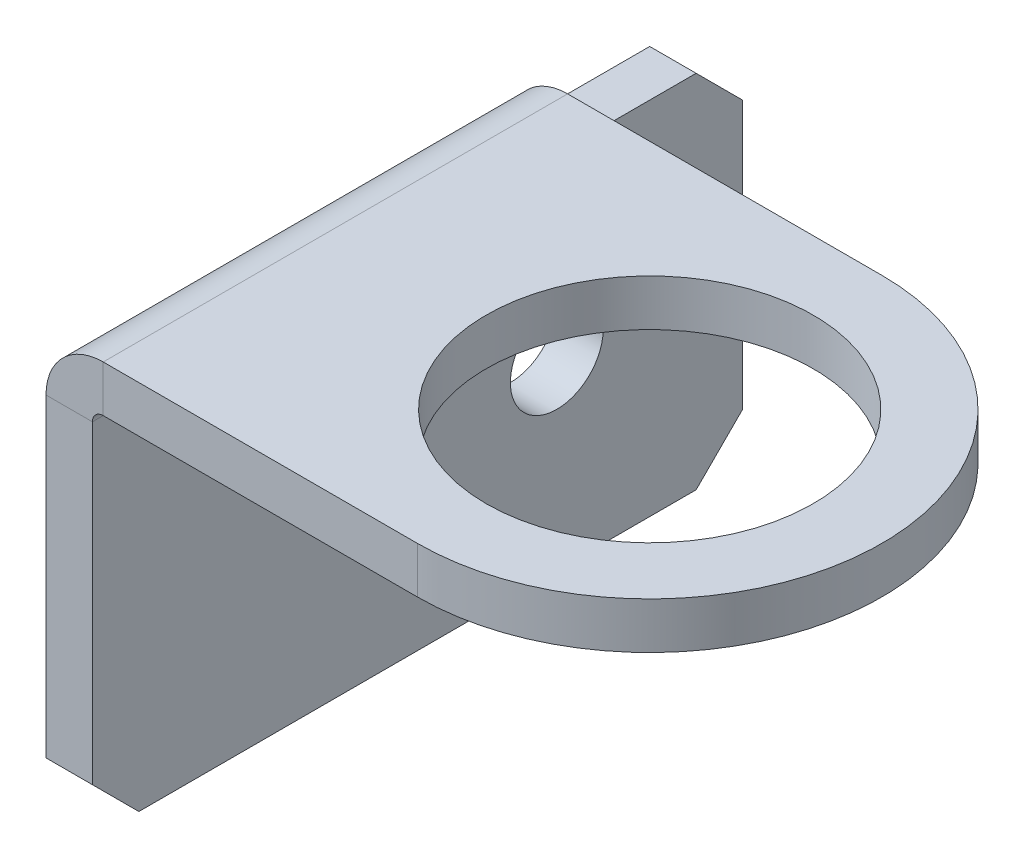
ISO-10303-21;
HEADER;
FILE_DESCRIPTION(('STEP AP214'),'2;1');
FILE_NAME('part.step','',(''),(''),'','','');
FILE_SCHEMA(('AUTOMOTIVE_DESIGN { 1 0 10303 214 1 1 1 1 }'));
ENDSEC;
DATA;
#1=APPLICATION_CONTEXT('core data for automotive mechanical design processes');
#2=APPLICATION_PROTOCOL_DEFINITION('international standard','automotive_design',2000,#1);
#3=PRODUCT_CONTEXT('',#1,'mechanical');
#4=PRODUCT('Part','Part','',(#3));
#5=PRODUCT_RELATED_PRODUCT_CATEGORY('part','',(#4));
#6=PRODUCT_DEFINITION_FORMATION('','',#4);
#7=PRODUCT_DEFINITION_CONTEXT('part definition',#1,'design');
#8=PRODUCT_DEFINITION('design','',#6,#7);
#9=PRODUCT_DEFINITION_SHAPE('','',#8);
#10=(LENGTH_UNIT() NAMED_UNIT(*) SI_UNIT(.MILLI.,.METRE.));
#11=(NAMED_UNIT(*) PLANE_ANGLE_UNIT() SI_UNIT($,.RADIAN.));
#12=(NAMED_UNIT(*) SI_UNIT($,.STERADIAN.) SOLID_ANGLE_UNIT());
#13=UNCERTAINTY_MEASURE_WITH_UNIT(LENGTH_MEASURE(1.E-05),#10,'distance_accuracy_value','');
#14=(GEOMETRIC_REPRESENTATION_CONTEXT(3) GLOBAL_UNCERTAINTY_ASSIGNED_CONTEXT((#13)) GLOBAL_UNIT_ASSIGNED_CONTEXT((#10,
#11,#12)) REPRESENTATION_CONTEXT('',''));
#15=CARTESIAN_POINT('',(0.,0.,0.));
#16=DIRECTION('',(0.,0.,1.));
#17=DIRECTION('',(1.,0.,0.));
#18=AXIS2_PLACEMENT_3D('',#15,#16,#17);
#19=CARTESIAN_POINT('',(0.,0.,15.875));
#20=DIRECTION('',(0.,1.,0.));
#21=DIRECTION('',(0.,0.,1.));
#22=AXIS2_PLACEMENT_3D('',#19,#20,#21);
#23=PLANE('',#22);
#24=CARTESIAN_POINT('',(22.225,0.,0.));
#25=DIRECTION('',(0.,1.,0.));
#26=DIRECTION('',(0.,0.,1.));
#27=AXIS2_PLACEMENT_3D('',#24,#25,#26);
#28=CIRCLE('',#27,11.176);
#29=CARTESIAN_POINT('',(22.225,0.,11.176));
#30=VERTEX_POINT('',#29);
#31=EDGE_CURVE('E274',#30,#30,#28,.T.);
#32=ORIENTED_EDGE('',*,*,#31,.T.);
#33=EDGE_LOOP('',(#32));
#34=FACE_BOUND('',#33,.T.);
#35=CARTESIAN_POINT('',(22.225,0.,0.));
#36=DIRECTION('',(0.,1.,0.));
#37=DIRECTION('',(0.,0.,1.));
#38=AXIS2_PLACEMENT_3D('',#35,#36,#37);
#39=CIRCLE('',#38,15.875);
#40=CARTESIAN_POINT('',(22.225,0.,15.875));
#41=VERTEX_POINT('',#40);
#42=CARTESIAN_POINT('',(22.225,0.,-15.875));
#43=VERTEX_POINT('',#42);
#44=EDGE_CURVE('E266',#41,#43,#39,.T.);
#45=ORIENTED_EDGE('',*,*,#44,.F.);
#46=DIRECTION('',(1.,0.,0.));
#47=VECTOR('',#46,1.);
#48=CARTESIAN_POINT('',(0.,0.,15.875));
#49=LINE('',#48,#47);
#50=CARTESIAN_POINT('',(0.7366,0.,15.875));
#51=VERTEX_POINT('',#50);
#52=EDGE_CURVE('E190',#51,#41,#49,.T.);
#53=ORIENTED_EDGE('',*,*,#52,.F.);
#54=DIRECTION('',(0.,0.,-1.));
#55=VECTOR('',#54,1.);
#56=CARTESIAN_POINT('',(0.7366,0.,15.875));
#57=LINE('',#56,#55);
#58=CARTESIAN_POINT('',(0.7366,0.,-15.875));
#59=VERTEX_POINT('',#58);
#60=EDGE_CURVE('E197',#51,#59,#57,.T.);
#61=ORIENTED_EDGE('',*,*,#60,.T.);
#62=DIRECTION('',(1.,0.,0.));
#63=VECTOR('',#62,1.);
#64=CARTESIAN_POINT('',(0.,0.,-15.875));
#65=LINE('',#64,#63);
#66=EDGE_CURVE('E193',#59,#43,#65,.T.);
#67=ORIENTED_EDGE('',*,*,#66,.T.);
#68=EDGE_LOOP('',(#45,#53,#61,#67));
#69=FACE_BOUND('',#68,.T.);
#70=ADVANCED_FACE('F63',(#34,#69),#23,.F.);
#71=CARTESIAN_POINT('',(0.,3.175,15.875));
#72=DIRECTION('',(0.,1.,0.));
#73=DIRECTION('',(0.,0.,1.));
#74=AXIS2_PLACEMENT_3D('',#71,#72,#73);
#75=PLANE('',#74);
#76=CARTESIAN_POINT('',(22.225,3.175,0.));
#77=DIRECTION('',(0.,1.,0.));
#78=DIRECTION('',(0.,0.,1.));
#79=AXIS2_PLACEMENT_3D('',#76,#77,#78);
#80=CIRCLE('',#79,11.176);
#81=CARTESIAN_POINT('',(22.225,3.175,11.176));
#82=VERTEX_POINT('',#81);
#83=EDGE_CURVE('E273',#82,#82,#80,.T.);
#84=ORIENTED_EDGE('',*,*,#83,.F.);
#85=EDGE_LOOP('',(#84));
#86=FACE_BOUND('',#85,.T.);
#87=DIRECTION('',(1.,0.,0.));
#88=VECTOR('',#87,1.);
#89=CARTESIAN_POINT('',(0.,3.175,15.875));
#90=LINE('',#89,#88);
#91=CARTESIAN_POINT('',(0.7366,3.175,15.875));
#92=VERTEX_POINT('',#91);
#93=CARTESIAN_POINT('',(22.225,3.175,15.875));
#94=VERTEX_POINT('',#93);
#95=EDGE_CURVE('E281',#92,#94,#90,.T.);
#96=ORIENTED_EDGE('',*,*,#95,.T.);
#97=CARTESIAN_POINT('',(22.225,3.175,0.));
#98=DIRECTION('',(0.,1.,0.));
#99=DIRECTION('',(0.,0.,1.));
#100=AXIS2_PLACEMENT_3D('',#97,#98,#99);
#101=CIRCLE('',#100,15.875);
#102=CARTESIAN_POINT('',(22.225,3.175,-15.875));
#103=VERTEX_POINT('',#102);
#104=EDGE_CURVE('E267',#94,#103,#101,.T.);
#105=ORIENTED_EDGE('',*,*,#104,.T.);
#106=DIRECTION('',(1.,0.,0.));
#107=VECTOR('',#106,1.);
#108=CARTESIAN_POINT('',(0.,3.175,-15.875));
#109=LINE('',#108,#107);
#110=CARTESIAN_POINT('',(0.7366,3.175,-15.875));
#111=VERTEX_POINT('',#110);
#112=EDGE_CURVE('E188',#111,#103,#109,.T.);
#113=ORIENTED_EDGE('',*,*,#112,.F.);
#114=DIRECTION('',(0.,0.,-1.));
#115=VECTOR('',#114,1.);
#116=CARTESIAN_POINT('',(0.7366,3.175,15.875));
#117=LINE('',#116,#115);
#118=EDGE_CURVE('E172',#92,#111,#117,.T.);
#119=ORIENTED_EDGE('',*,*,#118,.F.);
#120=EDGE_LOOP('',(#96,#105,#113,#119));
#121=FACE_BOUND('',#120,.T.);
#122=ADVANCED_FACE('F302',(#86,#121),#75,.T.);
#123=CARTESIAN_POINT('',(0.7366,-0.7366,15.875));
#124=DIRECTION('',(0.,0.,1.));
#125=DIRECTION('',(1.,0.,0.));
#126=AXIS2_PLACEMENT_3D('',#123,#124,#125);
#127=PLANE('',#126);
#128=ORIENTED_EDGE('',*,*,#52,.T.);
#129=DIRECTION('',(0.,-1.,0.));
#130=VECTOR('',#129,1.);
#131=CARTESIAN_POINT('',(22.225,0.,15.875));
#132=LINE('',#131,#130);
#133=EDGE_CURVE('E160',#41,#94,#132,.F.);
#134=ORIENTED_EDGE('',*,*,#133,.T.);
#135=ORIENTED_EDGE('',*,*,#95,.F.);
#136=DIRECTION('',(0.,-1.,0.));
#137=VECTOR('',#136,1.);
#138=CARTESIAN_POINT('',(0.7366,3.175,15.875));
#139=LINE('',#138,#137);
#140=EDGE_CURVE('E208',#92,#51,#139,.T.);
#141=ORIENTED_EDGE('',*,*,#140,.T.);
#142=EDGE_LOOP('',(#128,#134,#135,#141));
#143=FACE_BOUND('',#142,.T.);
#144=ADVANCED_FACE('F305',(#143),#127,.T.);
#145=CARTESIAN_POINT('',(0.,-0.7366,15.875));
#146=DIRECTION('',(0.,0.,1.));
#147=DIRECTION('',(1.,0.,0.));
#148=AXIS2_PLACEMENT_3D('',#145,#146,#147);
#149=PLANE('',#148);
#150=DIRECTION('',(-1.,0.,0.));
#151=VECTOR('',#150,1.);
#152=CARTESIAN_POINT('',(0.,-0.7366,15.875));
#153=LINE('',#152,#151);
#154=CARTESIAN_POINT('',(0.,-0.7366,15.875));
#155=VERTEX_POINT('',#154);
#156=CARTESIAN_POINT('',(-3.175,-0.7366,15.875));
#157=VERTEX_POINT('',#156);
#158=EDGE_CURVE('E210',#155,#157,#153,.T.);
#159=ORIENTED_EDGE('',*,*,#158,.F.);
#160=CARTESIAN_POINT('',(0.7366,-0.7366,15.875));
#161=DIRECTION('',(0.,0.,1.));
#162=DIRECTION('',(1.,0.,0.));
#163=AXIS2_PLACEMENT_3D('',#160,#161,#162);
#164=CIRCLE('',#163,0.7366);
#165=EDGE_CURVE('E201',#155,#51,#164,.F.);
#166=ORIENTED_EDGE('',*,*,#165,.T.);
#167=ORIENTED_EDGE('',*,*,#140,.F.);
#168=CARTESIAN_POINT('',(0.7366,-0.7366,15.875));
#169=DIRECTION('',(0.,0.,1.));
#170=DIRECTION('',(1.,0.,0.));
#171=AXIS2_PLACEMENT_3D('',#168,#169,#170);
#172=CIRCLE('',#171,3.9116);
#173=EDGE_CURVE('E284',#157,#92,#172,.F.);
#174=ORIENTED_EDGE('',*,*,#173,.F.);
#175=EDGE_LOOP('',(#159,#166,#167,#174));
#176=FACE_BOUND('',#175,.T.);
#177=ADVANCED_FACE('F308',(#176),#149,.T.);
#178=CARTESIAN_POINT('',(0.7366,3.175,15.875));
#179=DIRECTION('',(0.,0.,1.));
#180=DIRECTION('',(1.,0.,0.));
#181=AXIS2_PLACEMENT_3D('',#178,#179,#180);
#182=PLANE('',#181);
#183=DIRECTION('',(0.,1.,0.));
#184=VECTOR('',#183,1.);
#185=CARTESIAN_POINT('',(-3.175,-25.4,15.875));
#186=LINE('',#185,#184);
#187=CARTESIAN_POINT('',(-3.175,-22.225,15.875));
#188=VERTEX_POINT('',#187);
#189=EDGE_CURVE('E177',#188,#157,#186,.T.);
#190=ORIENTED_EDGE('',*,*,#189,.F.);
#191=DIRECTION('',(1.,0.,0.));
#192=VECTOR('',#191,1.);
#193=CARTESIAN_POINT('',(0.7366,-22.225,15.875));
#194=LINE('',#193,#192);
#195=CARTESIAN_POINT('',(0.,-22.225,15.875));
#196=VERTEX_POINT('',#195);
#197=EDGE_CURVE('E71',#188,#196,#194,.T.);
#198=ORIENTED_EDGE('',*,*,#197,.T.);
#199=DIRECTION('',(0.,1.,0.));
#200=VECTOR('',#199,1.);
#201=CARTESIAN_POINT('',(0.,-25.4,15.875));
#202=LINE('',#201,#200);
#203=EDGE_CURVE('E287',#196,#155,#202,.T.);
#204=ORIENTED_EDGE('',*,*,#203,.T.);
#205=ORIENTED_EDGE('',*,*,#158,.T.);
#206=EDGE_LOOP('',(#190,#198,#204,#205));
#207=FACE_BOUND('',#206,.T.);
#208=ADVANCED_FACE('F344',(#207),#182,.T.);
#209=CARTESIAN_POINT('',(0.7366,0.,-15.875));
#210=DIRECTION('',(0.,0.,-1.));
#211=DIRECTION('',(-1.,0.,0.));
#212=AXIS2_PLACEMENT_3D('',#209,#210,#211);
#213=PLANE('',#212);
#214=DIRECTION('',(0.,1.,0.));
#215=VECTOR('',#214,1.);
#216=CARTESIAN_POINT('',(0.7366,0.,-15.875));
#217=LINE('',#216,#215);
#218=EDGE_CURVE('E171',#59,#111,#217,.T.);
#219=ORIENTED_EDGE('',*,*,#218,.F.);
#220=CARTESIAN_POINT('',(0.7366,-0.7366,-15.875));
#221=DIRECTION('',(0.,0.,1.));
#222=DIRECTION('',(1.,0.,0.));
#223=AXIS2_PLACEMENT_3D('',#220,#221,#222);
#224=CIRCLE('',#223,0.7366);
#225=CARTESIAN_POINT('',(0.,-0.7366,-15.875));
#226=VERTEX_POINT('',#225);
#227=EDGE_CURVE('E170',#226,#59,#224,.F.);
#228=ORIENTED_EDGE('',*,*,#227,.F.);
#229=DIRECTION('',(1.,0.,0.));
#230=VECTOR('',#229,1.);
#231=CARTESIAN_POINT('',(-3.175,-0.7366,-15.875));
#232=LINE('',#231,#230);
#233=CARTESIAN_POINT('',(-3.175,-0.7366,-15.875));
#234=VERTEX_POINT('',#233);
#235=EDGE_CURVE('E154',#234,#226,#232,.T.);
#236=ORIENTED_EDGE('',*,*,#235,.F.);
#237=CARTESIAN_POINT('',(0.7366,-0.7366,-15.875));
#238=DIRECTION('',(0.,0.,1.));
#239=DIRECTION('',(1.,0.,0.));
#240=AXIS2_PLACEMENT_3D('',#237,#238,#239);
#241=CIRCLE('',#240,3.9116);
#242=EDGE_CURVE('E168',#234,#111,#241,.F.);
#243=ORIENTED_EDGE('',*,*,#242,.T.);
#244=EDGE_LOOP('',(#219,#228,#236,#243));
#245=FACE_BOUND('',#244,.T.);
#246=ADVANCED_FACE('F166',(#245),#213,.T.);
#247=CARTESIAN_POINT('',(-3.175,-0.7366,-15.875));
#248=DIRECTION('',(0.,0.,-1.));
#249=DIRECTION('',(-1.,0.,0.));
#250=AXIS2_PLACEMENT_3D('',#247,#248,#249);
#251=PLANE('',#250);
#252=DIRECTION('',(0.,-1.,0.));
#253=VECTOR('',#252,1.);
#254=CARTESIAN_POINT('',(22.225,0.,-15.875));
#255=LINE('',#254,#253);
#256=EDGE_CURVE('E270',#43,#103,#255,.F.);
#257=ORIENTED_EDGE('',*,*,#256,.F.);
#258=ORIENTED_EDGE('',*,*,#66,.F.);
#259=ORIENTED_EDGE('',*,*,#218,.T.);
#260=ORIENTED_EDGE('',*,*,#112,.T.);
#261=EDGE_LOOP('',(#257,#258,#259,#260));
#262=FACE_BOUND('',#261,.T.);
#263=ADVANCED_FACE('F298',(#262),#251,.T.);
#264=CARTESIAN_POINT('',(0.7366,-0.7366,15.875));
#265=DIRECTION('',(0.,0.,-1.));
#266=DIRECTION('',(-1.,0.,0.));
#267=AXIS2_PLACEMENT_3D('',#264,#265,#266);
#268=CYLINDRICAL_SURFACE('',#267,3.9116);
#269=ORIENTED_EDGE('',*,*,#242,.F.);
#270=DIRECTION('',(0.,0.,-1.));
#271=VECTOR('',#270,1.);
#272=CARTESIAN_POINT('',(-3.175,-0.7366,15.875));
#273=LINE('',#272,#271);
#274=EDGE_CURVE('E175',#157,#234,#273,.T.);
#275=ORIENTED_EDGE('',*,*,#274,.F.);
#276=ORIENTED_EDGE('',*,*,#173,.T.);
#277=ORIENTED_EDGE('',*,*,#118,.T.);
#278=EDGE_LOOP('',(#269,#275,#276,#277));
#279=FACE_BOUND('',#278,.T.);
#280=ADVANCED_FACE('F185',(#279),#268,.T.);
#281=CARTESIAN_POINT('',(-3.175,-25.4,15.875));
#282=DIRECTION('',(-1.,0.,0.));
#283=DIRECTION('',(0.,0.,1.));
#284=AXIS2_PLACEMENT_3D('',#281,#282,#283);
#285=PLANE('',#284);
#286=CARTESIAN_POINT('',(-3.175,-12.7,-15.875));
#287=DIRECTION('',(1.,0.,0.));
#288=DIRECTION('',(0.,0.,-1.));
#289=AXIS2_PLACEMENT_3D('',#286,#287,#288);
#290=CIRCLE('',#289,3.175);
#291=CARTESIAN_POINT('',(-3.175,-12.7,-19.05));
#292=VERTEX_POINT('',#291);
#293=EDGE_CURVE('E256',#292,#292,#290,.T.);
#294=ORIENTED_EDGE('',*,*,#293,.T.);
#295=EDGE_LOOP('',(#294));
#296=FACE_BOUND('',#295,.T.);
#297=DIRECTION('',(0.,0.,-1.));
#298=VECTOR('',#297,1.);
#299=CARTESIAN_POINT('',(-3.175,-25.4,15.875));
#300=LINE('',#299,#298);
#301=CARTESIAN_POINT('',(-3.175,-25.4,12.7));
#302=VERTEX_POINT('',#301);
#303=CARTESIAN_POINT('',(-3.175,-25.4,-25.4));
#304=VERTEX_POINT('',#303);
#305=EDGE_CURVE('E182',#302,#304,#300,.T.);
#306=ORIENTED_EDGE('',*,*,#305,.F.);
#307=DIRECTION('',(0.,-0.707106781186548,-0.707106781186548));
#308=VECTOR('',#307,1.);
#309=CARTESIAN_POINT('',(-3.175,-23.8125,14.2875));
#310=LINE('',#309,#308);
#311=EDGE_CURVE('E85',#302,#188,#310,.F.);
#312=ORIENTED_EDGE('',*,*,#311,.T.);
#313=ORIENTED_EDGE('',*,*,#189,.T.);
#314=ORIENTED_EDGE('',*,*,#274,.T.);
#315=DIRECTION('',(0.,0.,1.));
#316=VECTOR('',#315,1.);
#317=CARTESIAN_POINT('',(-3.175,-0.7366,-15.875));
#318=LINE('',#317,#316);
#319=CARTESIAN_POINT('',(-3.175,-0.7366,-25.4));
#320=VERTEX_POINT('',#319);
#321=EDGE_CURVE('E150',#320,#234,#318,.T.);
#322=ORIENTED_EDGE('',*,*,#321,.F.);
#323=DIRECTION('',(0.,0.707106781186548,0.707106781186548));
#324=VECTOR('',#323,1.);
#325=CARTESIAN_POINT('',(-3.175,7.5692,-17.0942));
#326=LINE('',#325,#324);
#327=CARTESIAN_POINT('',(-3.175,-3.9116,-28.575));
#328=VERTEX_POINT('',#327);
#329=EDGE_CURVE('E228',#320,#328,#326,.F.);
#330=ORIENTED_EDGE('',*,*,#329,.T.);
#331=DIRECTION('',(0.,1.,0.));
#332=VECTOR('',#331,1.);
#333=CARTESIAN_POINT('',(-3.175,-25.4,-28.575));
#334=LINE('',#333,#332);
#335=CARTESIAN_POINT('',(-3.175,-22.225,-28.575));
#336=VERTEX_POINT('',#335);
#337=EDGE_CURVE('E161',#336,#328,#334,.T.);
#338=ORIENTED_EDGE('',*,*,#337,.F.);
#339=DIRECTION('',(0.,0.707106781186548,-0.707106781186548));
#340=VECTOR('',#339,1.);
#341=CARTESIAN_POINT('',(-3.175,-46.0375,-4.7625));
#342=LINE('',#341,#340);
#343=EDGE_CURVE('E219',#336,#304,#342,.F.);
#344=ORIENTED_EDGE('',*,*,#343,.T.);
#345=EDGE_LOOP('',(#306,#312,#313,#314,#322,#330,#338,#344));
#346=FACE_BOUND('',#345,.T.);
#347=ADVANCED_FACE('F176',(#296,#346),#285,.T.);
#348=CARTESIAN_POINT('',(0.,-25.4,15.875));
#349=DIRECTION('',(0.,-1.,0.));
#350=DIRECTION('',(0.,0.,-1.));
#351=AXIS2_PLACEMENT_3D('',#348,#349,#350);
#352=PLANE('',#351);
#353=DIRECTION('',(0.,0.,-1.));
#354=VECTOR('',#353,1.);
#355=CARTESIAN_POINT('',(0.,-25.4,15.875));
#356=LINE('',#355,#354);
#357=CARTESIAN_POINT('',(0.,-25.4,12.7));
#358=VERTEX_POINT('',#357);
#359=CARTESIAN_POINT('',(0.,-25.4,-25.4));
#360=VERTEX_POINT('',#359);
#361=EDGE_CURVE('E203',#358,#360,#356,.T.);
#362=ORIENTED_EDGE('',*,*,#361,.F.);
#363=DIRECTION('',(-1.,0.,0.));
#364=VECTOR('',#363,1.);
#365=CARTESIAN_POINT('',(0.,-25.4,12.7));
#366=LINE('',#365,#364);
#367=EDGE_CURVE('E230',#358,#302,#366,.T.);
#368=ORIENTED_EDGE('',*,*,#367,.T.);
#369=ORIENTED_EDGE('',*,*,#305,.T.);
#370=DIRECTION('',(1.,0.,0.));
#371=VECTOR('',#370,1.);
#372=CARTESIAN_POINT('',(0.,-25.4,-25.4));
#373=LINE('',#372,#371);
#374=EDGE_CURVE('E212',#304,#360,#373,.T.);
#375=ORIENTED_EDGE('',*,*,#374,.T.);
#376=EDGE_LOOP('',(#362,#368,#369,#375));
#377=FACE_BOUND('',#376,.T.);
#378=ADVANCED_FACE('F236',(#377),#352,.T.);
#379=CARTESIAN_POINT('',(0.,-25.4,15.875));
#380=DIRECTION('',(-1.,0.,0.));
#381=DIRECTION('',(0.,0.,1.));
#382=AXIS2_PLACEMENT_3D('',#379,#380,#381);
#383=PLANE('',#382);
#384=CARTESIAN_POINT('',(0.,-12.7,-15.875));
#385=DIRECTION('',(1.,0.,0.));
#386=DIRECTION('',(0.,0.,-1.));
#387=AXIS2_PLACEMENT_3D('',#384,#385,#386);
#388=CIRCLE('',#387,3.175);
#389=CARTESIAN_POINT('',(0.,-12.7,-19.05));
#390=VERTEX_POINT('',#389);
#391=EDGE_CURVE('E260',#390,#390,#388,.T.);
#392=ORIENTED_EDGE('',*,*,#391,.F.);
#393=EDGE_LOOP('',(#392));
#394=FACE_BOUND('',#393,.T.);
#395=ORIENTED_EDGE('',*,*,#203,.F.);
#396=DIRECTION('',(0.,0.707106781186548,0.707106781186548));
#397=VECTOR('',#396,1.);
#398=CARTESIAN_POINT('',(0.,-25.4,12.7));
#399=LINE('',#398,#397);
#400=EDGE_CURVE('E12',#196,#358,#399,.F.);
#401=ORIENTED_EDGE('',*,*,#400,.T.);
#402=ORIENTED_EDGE('',*,*,#361,.T.);
#403=DIRECTION('',(0.,-0.707106781186548,0.707106781186548));
#404=VECTOR('',#403,1.);
#405=CARTESIAN_POINT('',(0.,-25.4,-25.4));
#406=LINE('',#405,#404);
#407=CARTESIAN_POINT('',(0.,-22.225,-28.575));
#408=VERTEX_POINT('',#407);
#409=EDGE_CURVE('E215',#360,#408,#406,.F.);
#410=ORIENTED_EDGE('',*,*,#409,.T.);
#411=DIRECTION('',(0.,1.,0.));
#412=VECTOR('',#411,1.);
#413=CARTESIAN_POINT('',(0.,-25.4,-28.575));
#414=LINE('',#413,#412);
#415=CARTESIAN_POINT('',(0.,-3.9116,-28.575));
#416=VERTEX_POINT('',#415);
#417=EDGE_CURVE('E251',#408,#416,#414,.T.);
#418=ORIENTED_EDGE('',*,*,#417,.T.);
#419=DIRECTION('',(0.,-0.707106781186548,-0.707106781186548));
#420=VECTOR('',#419,1.);
#421=CARTESIAN_POINT('',(0.,-3.9116,-28.575));
#422=LINE('',#421,#420);
#423=CARTESIAN_POINT('',(0.,-0.7366,-25.4));
#424=VERTEX_POINT('',#423);
#425=EDGE_CURVE('E225',#416,#424,#422,.F.);
#426=ORIENTED_EDGE('',*,*,#425,.T.);
#427=DIRECTION('',(0.,0.,1.));
#428=VECTOR('',#427,1.);
#429=CARTESIAN_POINT('',(0.,-0.7366,-15.875));
#430=LINE('',#429,#428);
#431=EDGE_CURVE('E255',#424,#226,#430,.T.);
#432=ORIENTED_EDGE('',*,*,#431,.T.);
#433=DIRECTION('',(0.,0.,-1.));
#434=VECTOR('',#433,1.);
#435=CARTESIAN_POINT('',(0.,-0.7366,15.875));
#436=LINE('',#435,#434);
#437=EDGE_CURVE('E200',#155,#226,#436,.T.);
#438=ORIENTED_EDGE('',*,*,#437,.F.);
#439=EDGE_LOOP('',(#395,#401,#402,#410,#418,#426,#432,#438));
#440=FACE_BOUND('',#439,.T.);
#441=ADVANCED_FACE('F250',(#394,#440),#383,.F.);
#442=CARTESIAN_POINT('',(0.7366,-0.7366,15.875));
#443=DIRECTION('',(0.,0.,-1.));
#444=DIRECTION('',(-1.,0.,0.));
#445=AXIS2_PLACEMENT_3D('',#442,#443,#444);
#446=CYLINDRICAL_SURFACE('',#445,0.7366);
#447=ORIENTED_EDGE('',*,*,#227,.T.);
#448=ORIENTED_EDGE('',*,*,#60,.F.);
#449=ORIENTED_EDGE('',*,*,#165,.F.);
#450=ORIENTED_EDGE('',*,*,#437,.T.);
#451=EDGE_LOOP('',(#447,#448,#449,#450));
#452=FACE_BOUND('',#451,.T.);
#453=ADVANCED_FACE('F312',(#452),#446,.F.);
#454=CARTESIAN_POINT('',(22.225,3.175,0.));
#455=DIRECTION('',(0.,1.,0.));
#456=DIRECTION('',(0.,0.,1.));
#457=AXIS2_PLACEMENT_3D('',#454,#455,#456);
#458=CYLINDRICAL_SURFACE('',#457,11.176);
#459=ORIENTED_EDGE('',*,*,#31,.F.);
#460=EDGE_LOOP('',(#459));
#461=FACE_BOUND('',#460,.T.);
#462=ORIENTED_EDGE('',*,*,#83,.T.);
#463=EDGE_LOOP('',(#462));
#464=FACE_BOUND('',#463,.T.);
#465=ADVANCED_FACE('F327',(#461,#464),#458,.F.);
#466=CARTESIAN_POINT('',(22.225,0.,0.));
#467=DIRECTION('',(0.,1.,0.));
#468=DIRECTION('',(0.,0.,1.));
#469=AXIS2_PLACEMENT_3D('',#466,#467,#468);
#470=CYLINDRICAL_SURFACE('',#469,15.875);
#471=ORIENTED_EDGE('',*,*,#44,.T.);
#472=ORIENTED_EDGE('',*,*,#256,.T.);
#473=ORIENTED_EDGE('',*,*,#104,.F.);
#474=ORIENTED_EDGE('',*,*,#133,.F.);
#475=EDGE_LOOP('',(#471,#472,#473,#474));
#476=FACE_BOUND('',#475,.T.);
#477=ADVANCED_FACE('F300',(#476),#470,.T.);
#478=CARTESIAN_POINT('',(-3.175,-0.7366,-15.875));
#479=DIRECTION('',(0.,1.,0.));
#480=DIRECTION('',(0.,0.,1.));
#481=AXIS2_PLACEMENT_3D('',#478,#479,#480);
#482=PLANE('',#481);
#483=ORIENTED_EDGE('',*,*,#431,.F.);
#484=DIRECTION('',(-1.,0.,0.));
#485=VECTOR('',#484,1.);
#486=CARTESIAN_POINT('',(-3.175,-0.7366,-25.4));
#487=LINE('',#486,#485);
#488=EDGE_CURVE('E157',#424,#320,#487,.T.);
#489=ORIENTED_EDGE('',*,*,#488,.T.);
#490=ORIENTED_EDGE('',*,*,#321,.T.);
#491=ORIENTED_EDGE('',*,*,#235,.T.);
#492=EDGE_LOOP('',(#483,#489,#490,#491));
#493=FACE_BOUND('',#492,.T.);
#494=ADVANCED_FACE('F153',(#493),#482,.T.);
#495=CARTESIAN_POINT('',(-3.175,-25.4,-28.575));
#496=DIRECTION('',(0.,0.,-1.));
#497=DIRECTION('',(-1.,0.,0.));
#498=AXIS2_PLACEMENT_3D('',#495,#496,#497);
#499=PLANE('',#498);
#500=ORIENTED_EDGE('',*,*,#337,.T.);
#501=DIRECTION('',(1.,0.,0.));
#502=VECTOR('',#501,1.);
#503=CARTESIAN_POINT('',(-3.175,-3.9116,-28.575));
#504=LINE('',#503,#502);
#505=EDGE_CURVE('E222',#328,#416,#504,.T.);
#506=ORIENTED_EDGE('',*,*,#505,.T.);
#507=ORIENTED_EDGE('',*,*,#417,.F.);
#508=DIRECTION('',(-1.,0.,0.));
#509=VECTOR('',#508,1.);
#510=CARTESIAN_POINT('',(-3.175,-22.225,-28.575));
#511=LINE('',#510,#509);
#512=EDGE_CURVE('E217',#408,#336,#511,.T.);
#513=ORIENTED_EDGE('',*,*,#512,.T.);
#514=EDGE_LOOP('',(#500,#506,#507,#513));
#515=FACE_BOUND('',#514,.T.);
#516=ADVANCED_FACE('F253',(#515),#499,.T.);
#517=CARTESIAN_POINT('',(-3.175,-12.7,-15.875));
#518=DIRECTION('',(1.,0.,0.));
#519=DIRECTION('',(0.,0.,-1.));
#520=AXIS2_PLACEMENT_3D('',#517,#518,#519);
#521=CYLINDRICAL_SURFACE('',#520,3.175);
#522=ORIENTED_EDGE('',*,*,#293,.F.);
#523=EDGE_LOOP('',(#522));
#524=FACE_BOUND('',#523,.T.);
#525=ORIENTED_EDGE('',*,*,#391,.T.);
#526=EDGE_LOOP('',(#525));
#527=FACE_BOUND('',#526,.T.);
#528=ADVANCED_FACE('F319',(#524,#527),#521,.F.);
#529=CARTESIAN_POINT('',(0.,-25.4,-25.4));
#530=DIRECTION('',(0.,0.707106781186547,0.707106781186547));
#531=DIRECTION('',(1.,0.,0.));
#532=AXIS2_PLACEMENT_3D('',#529,#530,#531);
#533=PLANE('',#532);
#534=ORIENTED_EDGE('',*,*,#343,.F.);
#535=ORIENTED_EDGE('',*,*,#512,.F.);
#536=ORIENTED_EDGE('',*,*,#409,.F.);
#537=ORIENTED_EDGE('',*,*,#374,.F.);
#538=EDGE_LOOP('',(#534,#535,#536,#537));
#539=FACE_BOUND('',#538,.T.);
#540=ADVANCED_FACE('F246',(#539),#533,.F.);
#541=CARTESIAN_POINT('',(-3.175,-3.9116,-28.575));
#542=DIRECTION('',(0.,-0.707106781186547,0.707106781186547));
#543=DIRECTION('',(1.,0.,0.));
#544=AXIS2_PLACEMENT_3D('',#541,#542,#543);
#545=PLANE('',#544);
#546=ORIENTED_EDGE('',*,*,#329,.F.);
#547=ORIENTED_EDGE('',*,*,#488,.F.);
#548=ORIENTED_EDGE('',*,*,#425,.F.);
#549=ORIENTED_EDGE('',*,*,#505,.F.);
#550=EDGE_LOOP('',(#546,#547,#548,#549));
#551=FACE_BOUND('',#550,.T.);
#552=ADVANCED_FACE('F314',(#551),#545,.F.);
#553=CARTESIAN_POINT('',(0.,-25.4,12.7));
#554=DIRECTION('',(0.,0.707106781186547,-0.707106781186547));
#555=DIRECTION('',(-1.,0.,0.));
#556=AXIS2_PLACEMENT_3D('',#553,#554,#555);
#557=PLANE('',#556);
#558=ORIENTED_EDGE('',*,*,#400,.F.);
#559=ORIENTED_EDGE('',*,*,#197,.F.);
#560=ORIENTED_EDGE('',*,*,#311,.F.);
#561=ORIENTED_EDGE('',*,*,#367,.F.);
#562=EDGE_LOOP('',(#558,#559,#560,#561));
#563=FACE_BOUND('',#562,.T.);
#564=ADVANCED_FACE('F65',(#563),#557,.F.);
#565=CLOSED_SHELL('',(#70,#122,#144,#177,#208,#246,#263,#280,#347,#378,#441,#453,#465,#477,#494,
#516,#528,#540,#552,#564));
#566=MANIFOLD_SOLID_BREP('B2',#565);
#567=ADVANCED_BREP_SHAPE_REPRESENTATION('',(#18,#566),#14);
#568=SHAPE_DEFINITION_REPRESENTATION(#9,#567);
ENDSEC;
END-ISO-10303-21;
